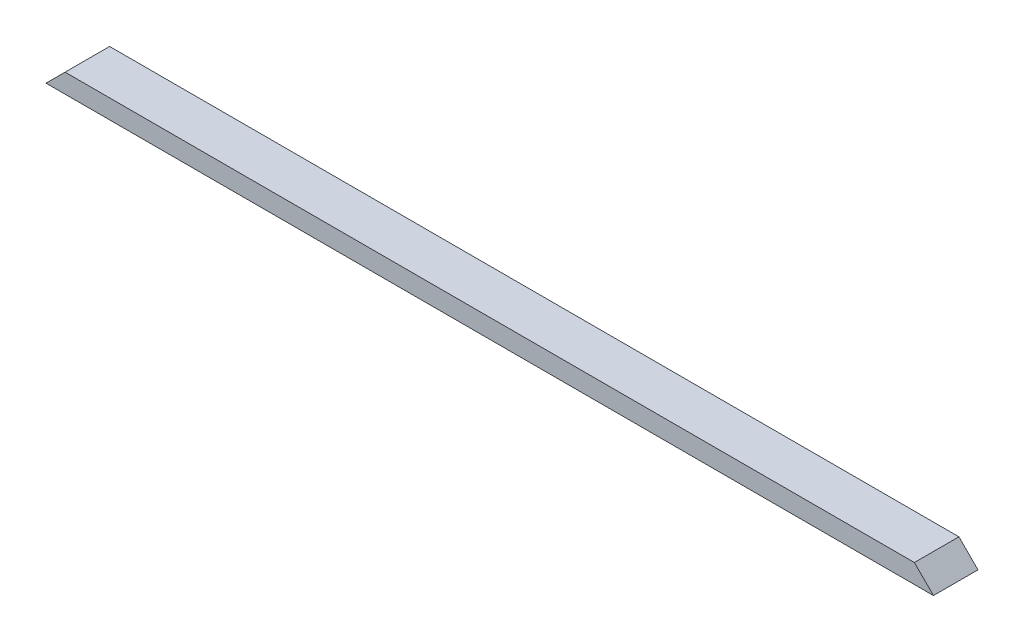
ISO-10303-21;
HEADER;
FILE_DESCRIPTION(('STEP AP214'),'2;1');
FILE_NAME('part.step','',(''),(''),'','','');
FILE_SCHEMA(('AUTOMOTIVE_DESIGN { 1 0 10303 214 1 1 1 1 }'));
ENDSEC;
DATA;
#1=APPLICATION_CONTEXT('core data for automotive mechanical design processes');
#2=APPLICATION_PROTOCOL_DEFINITION('international standard','automotive_design',2000,#1);
#3=PRODUCT_CONTEXT('',#1,'mechanical');
#4=PRODUCT('Part','Part','',(#3));
#5=PRODUCT_RELATED_PRODUCT_CATEGORY('part','',(#4));
#6=PRODUCT_DEFINITION_FORMATION('','',#4);
#7=PRODUCT_DEFINITION_CONTEXT('part definition',#1,'design');
#8=PRODUCT_DEFINITION('design','',#6,#7);
#9=PRODUCT_DEFINITION_SHAPE('','',#8);
#10=(LENGTH_UNIT() NAMED_UNIT(*) SI_UNIT(.MILLI.,.METRE.));
#11=(NAMED_UNIT(*) PLANE_ANGLE_UNIT() SI_UNIT($,.RADIAN.));
#12=(NAMED_UNIT(*) SI_UNIT($,.STERADIAN.) SOLID_ANGLE_UNIT());
#13=UNCERTAINTY_MEASURE_WITH_UNIT(LENGTH_MEASURE(1.E-05),#10,'distance_accuracy_value','');
#14=(GEOMETRIC_REPRESENTATION_CONTEXT(3) GLOBAL_UNCERTAINTY_ASSIGNED_CONTEXT((#13)) GLOBAL_UNIT_ASSIGNED_CONTEXT((#10,
#11,#12)) REPRESENTATION_CONTEXT('',''));
#15=CARTESIAN_POINT('',(0.,0.,0.));
#16=DIRECTION('',(0.,0.,1.));
#17=DIRECTION('',(1.,0.,0.));
#18=AXIS2_PLACEMENT_3D('',#15,#16,#17);
#19=CARTESIAN_POINT('',(0.,38.1,0.));
#20=DIRECTION('',(0.,0.,-1.));
#21=DIRECTION('',(-1.,0.,0.));
#22=AXIS2_PLACEMENT_3D('',#19,#20,#21);
#23=PLANE('',#22);
#24=DIRECTION('',(1.,0.,0.));
#25=VECTOR('',#24,1.);
#26=CARTESIAN_POINT('',(0.,38.1,0.));
#27=LINE('',#26,#25);
#28=CARTESIAN_POINT('',(38.1,38.1,0.));
#29=VERTEX_POINT('',#28);
#30=CARTESIAN_POINT('',(1733.55,38.1000000000001,0.));
#31=VERTEX_POINT('',#30);
#32=EDGE_CURVE('E47',#29,#31,#27,.T.);
#33=ORIENTED_EDGE('',*,*,#32,.F.);
#34=DIRECTION('',(0.707106781186547,0.707106781186547,0.));
#35=VECTOR('',#34,1.);
#36=CARTESIAN_POINT('',(0.,0.,0.));
#37=LINE('',#36,#35);
#38=CARTESIAN_POINT('',(0.,0.,0.));
#39=VERTEX_POINT('',#38);
#40=EDGE_CURVE('E82',#39,#29,#37,.T.);
#41=ORIENTED_EDGE('',*,*,#40,.F.);
#42=DIRECTION('',(1.,0.,0.));
#43=VECTOR('',#42,1.);
#44=CARTESIAN_POINT('',(0.,0.,0.));
#45=LINE('',#44,#43);
#46=CARTESIAN_POINT('',(1771.65,0.,0.));
#47=VERTEX_POINT('',#46);
#48=EDGE_CURVE('E87',#39,#47,#45,.T.);
#49=ORIENTED_EDGE('',*,*,#48,.T.);
#50=DIRECTION('',(0.707106781186547,-0.707106781186548,0.));
#51=VECTOR('',#50,1.);
#52=CARTESIAN_POINT('',(1733.55,38.1000000000001,0.));
#53=LINE('',#52,#51);
#54=EDGE_CURVE('E63',#31,#47,#53,.T.);
#55=ORIENTED_EDGE('',*,*,#54,.F.);
#56=EDGE_LOOP('',(#33,#41,#49,#55));
#57=FACE_BOUND('',#56,.T.);
#58=ADVANCED_FACE('F39',(#57),#23,.F.);
#59=CARTESIAN_POINT('',(0.,38.1,-88.9));
#60=DIRECTION('',(0.,0.,1.));
#61=DIRECTION('',(1.,0.,0.));
#62=AXIS2_PLACEMENT_3D('',#59,#60,#61);
#63=PLANE('',#62);
#64=DIRECTION('',(-1.,0.,0.));
#65=VECTOR('',#64,1.);
#66=CARTESIAN_POINT('',(0.,0.,-88.9));
#67=LINE('',#66,#65);
#68=CARTESIAN_POINT('',(1771.65,0.,-88.9));
#69=VERTEX_POINT('',#68);
#70=CARTESIAN_POINT('',(0.,0.,-88.9));
#71=VERTEX_POINT('',#70);
#72=EDGE_CURVE('E42',#69,#71,#67,.T.);
#73=ORIENTED_EDGE('',*,*,#72,.T.);
#74=DIRECTION('',(0.707106781186547,0.707106781186547,0.));
#75=VECTOR('',#74,1.);
#76=CARTESIAN_POINT('',(0.,0.,-88.9));
#77=LINE('',#76,#75);
#78=CARTESIAN_POINT('',(38.1,38.1,-88.9));
#79=VERTEX_POINT('',#78);
#80=EDGE_CURVE('E55',#71,#79,#77,.T.);
#81=ORIENTED_EDGE('',*,*,#80,.T.);
#82=DIRECTION('',(-1.,0.,0.));
#83=VECTOR('',#82,1.);
#84=CARTESIAN_POINT('',(0.,38.1,-88.9));
#85=LINE('',#84,#83);
#86=CARTESIAN_POINT('',(1733.55,38.1000000000001,-88.9));
#87=VERTEX_POINT('',#86);
#88=EDGE_CURVE('E11',#87,#79,#85,.T.);
#89=ORIENTED_EDGE('',*,*,#88,.F.);
#90=DIRECTION('',(0.707106781186547,-0.707106781186548,0.));
#91=VECTOR('',#90,1.);
#92=CARTESIAN_POINT('',(1733.55,38.1000000000001,-88.9));
#93=LINE('',#92,#91);
#94=EDGE_CURVE('E100',#87,#69,#93,.T.);
#95=ORIENTED_EDGE('',*,*,#94,.T.);
#96=EDGE_LOOP('',(#73,#81,#89,#95));
#97=FACE_BOUND('',#96,.T.);
#98=ADVANCED_FACE('F109',(#97),#63,.F.);
#99=CARTESIAN_POINT('',(0.,38.1,0.));
#100=DIRECTION('',(0.,-1.,0.));
#101=DIRECTION('',(0.,0.,-1.));
#102=AXIS2_PLACEMENT_3D('',#99,#100,#101);
#103=PLANE('',#102);
#104=ORIENTED_EDGE('',*,*,#88,.T.);
#105=DIRECTION('',(0.,0.,1.));
#106=VECTOR('',#105,1.);
#107=CARTESIAN_POINT('',(38.1,38.1,-88.9));
#108=LINE('',#107,#106);
#109=EDGE_CURVE('E88',#79,#29,#108,.T.);
#110=ORIENTED_EDGE('',*,*,#109,.T.);
#111=ORIENTED_EDGE('',*,*,#32,.T.);
#112=DIRECTION('',(0.,0.,1.));
#113=VECTOR('',#112,1.);
#114=CARTESIAN_POINT('',(1733.55,38.1000000000001,-88.9));
#115=LINE('',#114,#113);
#116=EDGE_CURVE('E103',#87,#31,#115,.T.);
#117=ORIENTED_EDGE('',*,*,#116,.F.);
#118=EDGE_LOOP('',(#104,#110,#111,#117));
#119=FACE_BOUND('',#118,.T.);
#120=ADVANCED_FACE('F112',(#119),#103,.F.);
#121=CARTESIAN_POINT('',(0.,0.,0.));
#122=DIRECTION('',(0.,-1.,0.));
#123=DIRECTION('',(0.,0.,-1.));
#124=AXIS2_PLACEMENT_3D('',#121,#122,#123);
#125=PLANE('',#124);
#126=DIRECTION('',(0.,0.,1.));
#127=VECTOR('',#126,1.);
#128=CARTESIAN_POINT('',(0.,0.,0.));
#129=LINE('',#128,#127);
#130=EDGE_CURVE('E79',#71,#39,#129,.T.);
#131=ORIENTED_EDGE('',*,*,#130,.F.);
#132=ORIENTED_EDGE('',*,*,#72,.F.);
#133=DIRECTION('',(0.,0.,-1.));
#134=VECTOR('',#133,1.);
#135=CARTESIAN_POINT('',(1771.65,0.,0.));
#136=LINE('',#135,#134);
#137=EDGE_CURVE('E96',#47,#69,#136,.T.);
#138=ORIENTED_EDGE('',*,*,#137,.F.);
#139=ORIENTED_EDGE('',*,*,#48,.F.);
#140=EDGE_LOOP('',(#131,#132,#138,#139));
#141=FACE_BOUND('',#140,.T.);
#142=ADVANCED_FACE('F95',(#141),#125,.T.);
#143=CARTESIAN_POINT('',(1733.55,38.1000000000001,-88.9));
#144=DIRECTION('',(-0.707106781186548,-0.707106781186547,0.));
#145=DIRECTION('',(0.707106781186547,-0.707106781186548,0.));
#146=AXIS2_PLACEMENT_3D('',#143,#144,#145);
#147=PLANE('',#146);
#148=ORIENTED_EDGE('',*,*,#54,.T.);
#149=ORIENTED_EDGE('',*,*,#137,.T.);
#150=ORIENTED_EDGE('',*,*,#94,.F.);
#151=ORIENTED_EDGE('',*,*,#116,.T.);
#152=EDGE_LOOP('',(#148,#149,#150,#151));
#153=FACE_BOUND('',#152,.T.);
#154=ADVANCED_FACE('F113',(#153),#147,.F.);
#155=CARTESIAN_POINT('',(0.,0.,-88.9));
#156=DIRECTION('',(0.707106781186547,-0.707106781186547,0.));
#157=DIRECTION('',(0.707106781186548,0.707106781186548,0.));
#158=AXIS2_PLACEMENT_3D('',#155,#156,#157);
#159=PLANE('',#158);
#160=ORIENTED_EDGE('',*,*,#40,.T.);
#161=ORIENTED_EDGE('',*,*,#109,.F.);
#162=ORIENTED_EDGE('',*,*,#80,.F.);
#163=ORIENTED_EDGE('',*,*,#130,.T.);
#164=EDGE_LOOP('',(#160,#161,#162,#163));
#165=FACE_BOUND('',#164,.T.);
#166=ADVANCED_FACE('F81',(#165),#159,.F.);
#167=CLOSED_SHELL('',(#58,#98,#120,#142,#154,#166));
#168=MANIFOLD_SOLID_BREP('B2',#167);
#169=ADVANCED_BREP_SHAPE_REPRESENTATION('',(#18,#168),#14);
#170=SHAPE_DEFINITION_REPRESENTATION(#9,#169);
ENDSEC;
END-ISO-10303-21;
